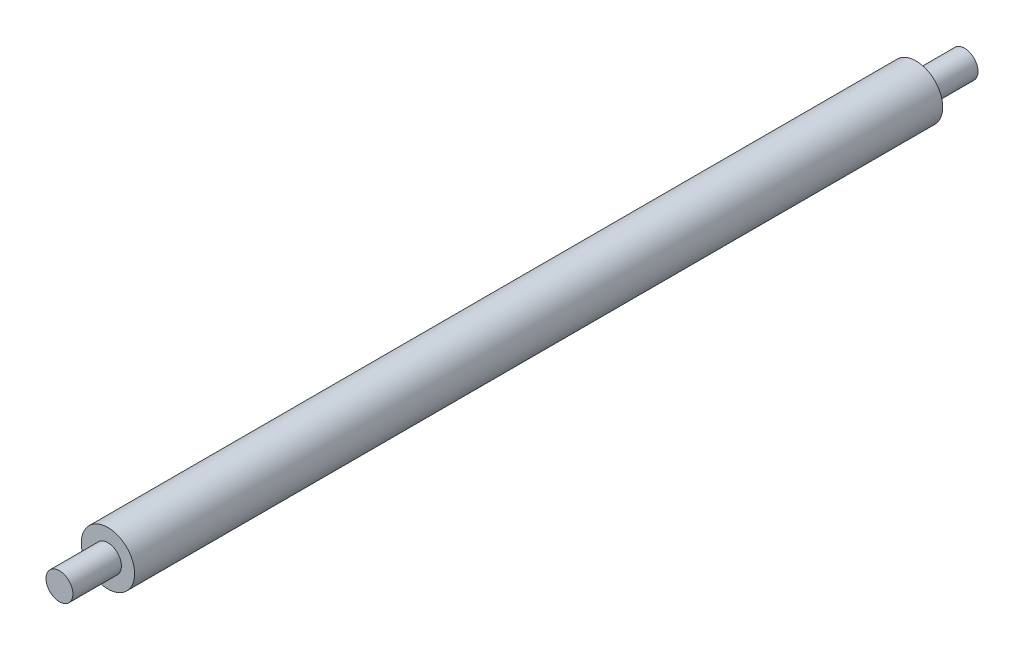
ISO-10303-21;
HEADER;
FILE_DESCRIPTION(('STEP AP214'),'2;1');
FILE_NAME('part.step','',(''),(''),'','','');
FILE_SCHEMA(('AUTOMOTIVE_DESIGN { 1 0 10303 214 1 1 1 1 }'));
ENDSEC;
DATA;
#1=APPLICATION_CONTEXT('core data for automotive mechanical design processes');
#2=APPLICATION_PROTOCOL_DEFINITION('international standard','automotive_design',2000,#1);
#3=PRODUCT_CONTEXT('',#1,'mechanical');
#4=PRODUCT('Part','Part','',(#3));
#5=PRODUCT_RELATED_PRODUCT_CATEGORY('part','',(#4));
#6=PRODUCT_DEFINITION_FORMATION('','',#4);
#7=PRODUCT_DEFINITION_CONTEXT('part definition',#1,'design');
#8=PRODUCT_DEFINITION('design','',#6,#7);
#9=PRODUCT_DEFINITION_SHAPE('','',#8);
#10=(LENGTH_UNIT() NAMED_UNIT(*) SI_UNIT(.MILLI.,.METRE.));
#11=(NAMED_UNIT(*) PLANE_ANGLE_UNIT() SI_UNIT($,.RADIAN.));
#12=(NAMED_UNIT(*) SI_UNIT($,.STERADIAN.) SOLID_ANGLE_UNIT());
#13=UNCERTAINTY_MEASURE_WITH_UNIT(LENGTH_MEASURE(1.E-05),#10,'distance_accuracy_value','');
#14=(GEOMETRIC_REPRESENTATION_CONTEXT(3) GLOBAL_UNCERTAINTY_ASSIGNED_CONTEXT((#13)) GLOBAL_UNIT_ASSIGNED_CONTEXT((#10,
#11,#12)) REPRESENTATION_CONTEXT('',''));
#15=CARTESIAN_POINT('',(0.,0.,0.));
#16=DIRECTION('',(0.,0.,1.));
#17=DIRECTION('',(1.,0.,0.));
#18=AXIS2_PLACEMENT_3D('',#15,#16,#17);
#19=CARTESIAN_POINT('',(0.,0.,750.));
#20=DIRECTION('',(0.,0.,1.));
#21=DIRECTION('',(1.,0.,0.));
#22=AXIS2_PLACEMENT_3D('',#19,#20,#21);
#23=PLANE('',#22);
#24=CARTESIAN_POINT('',(0.,0.,750.));
#25=DIRECTION('',(0.,0.,1.));
#26=DIRECTION('',(1.,0.,0.));
#27=AXIS2_PLACEMENT_3D('',#24,#25,#26);
#28=CIRCLE('',#27,24.75);
#29=CARTESIAN_POINT('',(24.75,0.,750.));
#30=VERTEX_POINT('',#29);
#31=EDGE_CURVE('E47',#30,#30,#28,.T.);
#32=ORIENTED_EDGE('',*,*,#31,.T.);
#33=EDGE_LOOP('',(#32));
#34=FACE_BOUND('',#33,.T.);
#35=CARTESIAN_POINT('',(0.,0.,750.));
#36=DIRECTION('',(0.,0.,1.));
#37=DIRECTION('',(1.,0.,0.));
#38=AXIS2_PLACEMENT_3D('',#35,#36,#37);
#39=CIRCLE('',#38,12.5);
#40=CARTESIAN_POINT('',(12.5,0.,750.));
#41=VERTEX_POINT('',#40);
#42=EDGE_CURVE('E63',#41,#41,#39,.T.);
#43=ORIENTED_EDGE('',*,*,#42,.F.);
#44=EDGE_LOOP('',(#43));
#45=FACE_BOUND('',#44,.T.);
#46=ADVANCED_FACE('F38',(#34,#45),#23,.T.);
#47=CARTESIAN_POINT('',(0.,0.,0.));
#48=DIRECTION('',(0.,0.,1.));
#49=DIRECTION('',(1.,0.,0.));
#50=AXIS2_PLACEMENT_3D('',#47,#48,#49);
#51=PLANE('',#50);
#52=CARTESIAN_POINT('',(0.,0.,0.));
#53=DIRECTION('',(0.,0.,1.));
#54=DIRECTION('',(1.,0.,0.));
#55=AXIS2_PLACEMENT_3D('',#52,#53,#54);
#56=CIRCLE('',#55,24.75);
#57=CARTESIAN_POINT('',(24.75,0.,0.));
#58=VERTEX_POINT('',#57);
#59=EDGE_CURVE('E52',#58,#58,#56,.T.);
#60=ORIENTED_EDGE('',*,*,#59,.F.);
#61=EDGE_LOOP('',(#60));
#62=FACE_BOUND('',#61,.T.);
#63=CARTESIAN_POINT('',(0.,0.,0.));
#64=DIRECTION('',(0.,0.,1.));
#65=DIRECTION('',(1.,0.,0.));
#66=AXIS2_PLACEMENT_3D('',#63,#64,#65);
#67=CIRCLE('',#66,12.5);
#68=CARTESIAN_POINT('',(12.5,0.,0.));
#69=VERTEX_POINT('',#68);
#70=EDGE_CURVE('E71',#69,#69,#67,.T.);
#71=ORIENTED_EDGE('',*,*,#70,.T.);
#72=EDGE_LOOP('',(#71));
#73=FACE_BOUND('',#72,.T.);
#74=ADVANCED_FACE('F89',(#62,#73),#51,.F.);
#75=CARTESIAN_POINT('',(0.,0.,750.));
#76=DIRECTION('',(0.,0.,-1.));
#77=DIRECTION('',(-1.,0.,0.));
#78=AXIS2_PLACEMENT_3D('',#75,#76,#77);
#79=CYLINDRICAL_SURFACE('',#78,24.75);
#80=ORIENTED_EDGE('',*,*,#31,.F.);
#81=EDGE_LOOP('',(#80));
#82=FACE_BOUND('',#81,.T.);
#83=ORIENTED_EDGE('',*,*,#59,.T.);
#84=EDGE_LOOP('',(#83));
#85=FACE_BOUND('',#84,.T.);
#86=ADVANCED_FACE('F40',(#82,#85),#79,.T.);
#87=CARTESIAN_POINT('',(0.,0.,745.));
#88=DIRECTION('',(0.,0.,1.));
#89=DIRECTION('',(1.,0.,0.));
#90=AXIS2_PLACEMENT_3D('',#87,#88,#89);
#91=CYLINDRICAL_SURFACE('',#90,12.5);
#92=ORIENTED_EDGE('',*,*,#42,.T.);
#93=EDGE_LOOP('',(#92));
#94=FACE_BOUND('',#93,.T.);
#95=CARTESIAN_POINT('',(0.,0.,795.));
#96=DIRECTION('',(0.,0.,1.));
#97=DIRECTION('',(1.,0.,0.));
#98=AXIS2_PLACEMENT_3D('',#95,#96,#97);
#99=CIRCLE('',#98,12.5);
#100=CARTESIAN_POINT('',(12.5,0.,795.));
#101=VERTEX_POINT('',#100);
#102=EDGE_CURVE('E67',#101,#101,#99,.T.);
#103=ORIENTED_EDGE('',*,*,#102,.F.);
#104=EDGE_LOOP('',(#103));
#105=FACE_BOUND('',#104,.T.);
#106=ADVANCED_FACE('F96',(#94,#105),#91,.T.);
#107=CARTESIAN_POINT('',(0.,0.,795.));
#108=DIRECTION('',(0.,0.,1.));
#109=DIRECTION('',(1.,0.,0.));
#110=AXIS2_PLACEMENT_3D('',#107,#108,#109);
#111=PLANE('',#110);
#112=ORIENTED_EDGE('',*,*,#102,.T.);
#113=EDGE_LOOP('',(#112));
#114=FACE_BOUND('',#113,.T.);
#115=ADVANCED_FACE('F85',(#114),#111,.T.);
#116=CARTESIAN_POINT('',(0.,0.,5.));
#117=DIRECTION('',(0.,0.,-1.));
#118=DIRECTION('',(-1.,0.,0.));
#119=AXIS2_PLACEMENT_3D('',#116,#117,#118);
#120=CYLINDRICAL_SURFACE('',#119,12.5);
#121=CARTESIAN_POINT('',(0.,0.,-45.));
#122=DIRECTION('',(0.,0.,-1.));
#123=DIRECTION('',(-1.,0.,0.));
#124=AXIS2_PLACEMENT_3D('',#121,#122,#123);
#125=CIRCLE('',#124,12.5);
#126=CARTESIAN_POINT('',(-12.5,0.,-45.));
#127=VERTEX_POINT('',#126);
#128=EDGE_CURVE('E75',#127,#127,#125,.T.);
#129=ORIENTED_EDGE('',*,*,#128,.F.);
#130=EDGE_LOOP('',(#129));
#131=FACE_BOUND('',#130,.T.);
#132=ORIENTED_EDGE('',*,*,#70,.F.);
#133=EDGE_LOOP('',(#132));
#134=FACE_BOUND('',#133,.T.);
#135=ADVANCED_FACE('F82',(#131,#134),#120,.T.);
#136=CARTESIAN_POINT('',(0.,0.,-45.));
#137=DIRECTION('',(0.,0.,-1.));
#138=DIRECTION('',(-1.,0.,0.));
#139=AXIS2_PLACEMENT_3D('',#136,#137,#138);
#140=PLANE('',#139);
#141=ORIENTED_EDGE('',*,*,#128,.T.);
#142=EDGE_LOOP('',(#141));
#143=FACE_BOUND('',#142,.T.);
#144=ADVANCED_FACE('F80',(#143),#140,.T.);
#145=CLOSED_SHELL('',(#46,#74,#86,#106,#115,#135,#144));
#146=CARTESIAN_POINT('',(0.,0.,745.));
#147=DIRECTION('',(0.,0.,1.));
#148=DIRECTION('',(1.,0.,0.));
#149=AXIS2_PLACEMENT_3D('',#146,#147,#148);
#150=PLANE('',#149);
#151=CARTESIAN_POINT('',(0.,0.,745.));
#152=DIRECTION('',(0.,0.,1.));
#153=DIRECTION('',(1.,0.,0.));
#154=AXIS2_PLACEMENT_3D('',#151,#152,#153);
#155=CIRCLE('',#154,21.75);
#156=CARTESIAN_POINT('',(21.75,0.,745.));
#157=VERTEX_POINT('',#156);
#158=EDGE_CURVE('E58',#157,#157,#155,.T.);
#159=ORIENTED_EDGE('',*,*,#158,.F.);
#160=EDGE_LOOP('',(#159));
#161=FACE_BOUND('',#160,.T.);
#162=ADVANCED_FACE('F105',(#161),#150,.F.);
#163=CARTESIAN_POINT('',(0.,0.,750.));
#164=DIRECTION('',(0.,0.,-1.));
#165=DIRECTION('',(-1.,0.,0.));
#166=AXIS2_PLACEMENT_3D('',#163,#164,#165);
#167=CYLINDRICAL_SURFACE('',#166,21.75);
#168=CARTESIAN_POINT('',(0.,0.,5.));
#169=DIRECTION('',(0.,0.,1.));
#170=DIRECTION('',(1.,0.,0.));
#171=AXIS2_PLACEMENT_3D('',#168,#169,#170);
#172=CIRCLE('',#171,21.75);
#173=CARTESIAN_POINT('',(21.75,0.,5.));
#174=VERTEX_POINT('',#173);
#175=EDGE_CURVE('E10',#174,#174,#172,.T.);
#176=ORIENTED_EDGE('',*,*,#175,.F.);
#177=EDGE_LOOP('',(#176));
#178=FACE_BOUND('',#177,.T.);
#179=ORIENTED_EDGE('',*,*,#158,.T.);
#180=EDGE_LOOP('',(#179));
#181=FACE_BOUND('',#180,.T.);
#182=ADVANCED_FACE('F101',(#178,#181),#167,.F.);
#183=CARTESIAN_POINT('',(0.,0.,5.));
#184=DIRECTION('',(0.,0.,1.));
#185=DIRECTION('',(1.,0.,0.));
#186=AXIS2_PLACEMENT_3D('',#183,#184,#185);
#187=PLANE('',#186);
#188=ORIENTED_EDGE('',*,*,#175,.T.);
#189=EDGE_LOOP('',(#188));
#190=FACE_BOUND('',#189,.T.);
#191=ADVANCED_FACE('F104',(#190),#187,.T.);
#192=CLOSED_SHELL('',(#162,#182,#191));
#193=ORIENTED_CLOSED_SHELL('',*,#192,.T.);
#194=BREP_WITH_VOIDS('B2',#145,(#193));
#195=ADVANCED_BREP_SHAPE_REPRESENTATION('',(#18,#194),#14);
#196=SHAPE_DEFINITION_REPRESENTATION(#9,#195);
ENDSEC;
END-ISO-10303-21;
